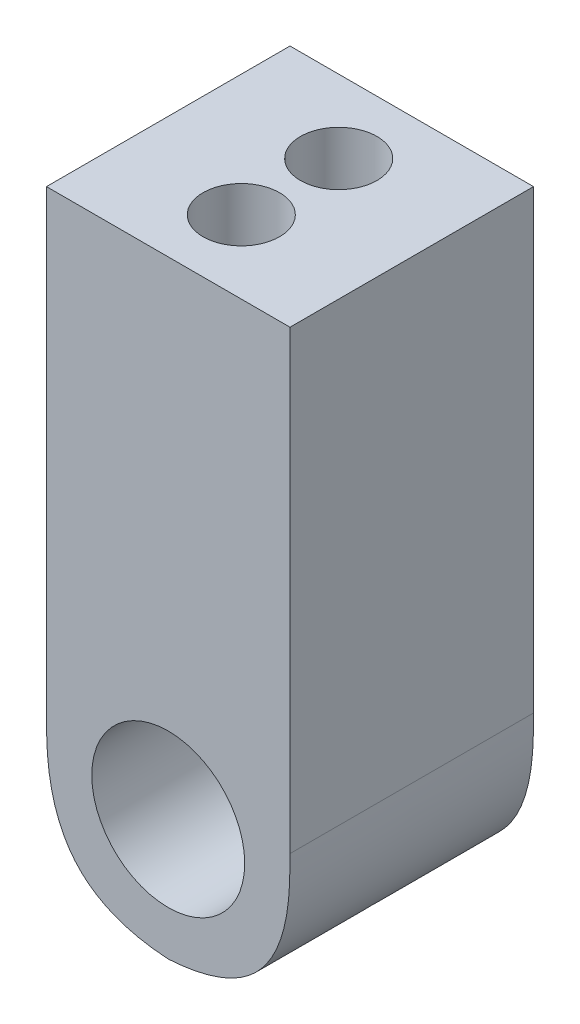
ISO-10303-21;
HEADER;
FILE_DESCRIPTION(('STEP AP214'),'2;1');
FILE_NAME('part.step','',(''),(''),'','','');
FILE_SCHEMA(('AUTOMOTIVE_DESIGN { 1 0 10303 214 1 1 1 1 }'));
ENDSEC;
DATA;
#1=APPLICATION_CONTEXT('core data for automotive mechanical design processes');
#2=APPLICATION_PROTOCOL_DEFINITION('international standard','automotive_design',2000,#1);
#3=PRODUCT_CONTEXT('',#1,'mechanical');
#4=PRODUCT('Part','Part','',(#3));
#5=PRODUCT_RELATED_PRODUCT_CATEGORY('part','',(#4));
#6=PRODUCT_DEFINITION_FORMATION('','',#4);
#7=PRODUCT_DEFINITION_CONTEXT('part definition',#1,'design');
#8=PRODUCT_DEFINITION('design','',#6,#7);
#9=PRODUCT_DEFINITION_SHAPE('','',#8);
#10=(LENGTH_UNIT() NAMED_UNIT(*) SI_UNIT(.MILLI.,.METRE.));
#11=(NAMED_UNIT(*) PLANE_ANGLE_UNIT() SI_UNIT($,.RADIAN.));
#12=(NAMED_UNIT(*) SI_UNIT($,.STERADIAN.) SOLID_ANGLE_UNIT());
#13=UNCERTAINTY_MEASURE_WITH_UNIT(LENGTH_MEASURE(1.E-05),#10,'distance_accuracy_value','');
#14=(GEOMETRIC_REPRESENTATION_CONTEXT(3) GLOBAL_UNCERTAINTY_ASSIGNED_CONTEXT((#13)) GLOBAL_UNIT_ASSIGNED_CONTEXT((#10,
#11,#12)) REPRESENTATION_CONTEXT('',''));
#15=CARTESIAN_POINT('',(0.,0.,0.));
#16=DIRECTION('',(0.,0.,1.));
#17=DIRECTION('',(1.,0.,0.));
#18=AXIS2_PLACEMENT_3D('',#15,#16,#17);
#19=CARTESIAN_POINT('',(-6.35,0.,-12.7));
#20=DIRECTION('',(1.,0.,0.));
#21=DIRECTION('',(0.,0.,-1.));
#22=AXIS2_PLACEMENT_3D('',#19,#20,#21);
#23=PLANE('',#22);
#24=DIRECTION('',(0.,1.,0.));
#25=VECTOR('',#24,1.);
#26=CARTESIAN_POINT('',(-6.35,0.,-12.7));
#27=LINE('',#26,#25);
#28=CARTESIAN_POINT('',(-6.35,1.6256,-12.7));
#29=VERTEX_POINT('',#28);
#30=CARTESIAN_POINT('',(-6.35,25.4,-12.7));
#31=VERTEX_POINT('',#30);
#32=EDGE_CURVE('E99',#29,#31,#27,.T.);
#33=ORIENTED_EDGE('',*,*,#32,.F.);
#34=CARTESIAN_POINT('',(-6.35,1.6256,0.635));
#35=CARTESIAN_POINT('',(-6.35,1.6256,-4.02166666666667));
#36=CARTESIAN_POINT('',(-6.35,1.6256,-8.67833333332475));
#37=CARTESIAN_POINT('',(-6.35,1.6256,-13.335));
#38=B_SPLINE_CURVE_WITH_KNOTS('',3,(#34,#35,#36,#37),.UNSPECIFIED.,.F.,.F.,(4,4),(-0.013335,
0.000635),.UNSPECIFIED.);
#39=CARTESIAN_POINT('',(-6.35,1.6256,0.));
#40=VERTEX_POINT('',#39);
#41=EDGE_CURVE('E113',#29,#40,#38,.F.);
#42=ORIENTED_EDGE('',*,*,#41,.T.);
#43=DIRECTION('',(0.,1.,0.));
#44=VECTOR('',#43,1.);
#45=CARTESIAN_POINT('',(-6.35,0.,0.));
#46=LINE('',#45,#44);
#47=CARTESIAN_POINT('',(-6.35,25.4,0.));
#48=VERTEX_POINT('',#47);
#49=EDGE_CURVE('E117',#40,#48,#46,.T.);
#50=ORIENTED_EDGE('',*,*,#49,.T.);
#51=DIRECTION('',(0.,0.,1.));
#52=VECTOR('',#51,1.);
#53=CARTESIAN_POINT('',(-6.35,25.4,-12.7));
#54=LINE('',#53,#52);
#55=EDGE_CURVE('E111',#31,#48,#54,.T.);
#56=ORIENTED_EDGE('',*,*,#55,.F.);
#57=EDGE_LOOP('',(#33,#42,#50,#56));
#58=FACE_BOUND('',#57,.T.);
#59=ADVANCED_FACE('F40',(#58),#23,.F.);
#60=CARTESIAN_POINT('',(0.,25.4,-12.7));
#61=DIRECTION('',(0.,-1.,0.));
#62=DIRECTION('',(0.,0.,-1.));
#63=AXIS2_PLACEMENT_3D('',#60,#61,#62);
#64=PLANE('',#63);
#65=CARTESIAN_POINT('',(0.,25.4,-8.89));
#66=DIRECTION('',(0.,1.,0.));
#67=DIRECTION('',(0.,0.,1.));
#68=AXIS2_PLACEMENT_3D('',#65,#66,#67);
#69=CIRCLE('',#68,1.9939);
#70=CARTESIAN_POINT('',(0.,25.4,-6.8961));
#71=VERTEX_POINT('',#70);
#72=EDGE_CURVE('E176',#71,#71,#69,.T.);
#73=ORIENTED_EDGE('',*,*,#72,.F.);
#74=EDGE_LOOP('',(#73));
#75=FACE_BOUND('',#74,.T.);
#76=CARTESIAN_POINT('',(0.,25.4,-3.81));
#77=DIRECTION('',(0.,1.,0.));
#78=DIRECTION('',(0.,0.,1.));
#79=AXIS2_PLACEMENT_3D('',#76,#77,#78);
#80=CIRCLE('',#79,1.9939);
#81=CARTESIAN_POINT('',(0.,25.4,-1.8161));
#82=VERTEX_POINT('',#81);
#83=EDGE_CURVE('E169',#82,#82,#80,.T.);
#84=ORIENTED_EDGE('',*,*,#83,.F.);
#85=EDGE_LOOP('',(#84));
#86=FACE_BOUND('',#85,.T.);
#87=DIRECTION('',(1.,0.,0.));
#88=VECTOR('',#87,1.);
#89=CARTESIAN_POINT('',(0.,25.4,0.));
#90=LINE('',#89,#88);
#91=CARTESIAN_POINT('',(6.35,25.4,0.));
#92=VERTEX_POINT('',#91);
#93=EDGE_CURVE('E110',#48,#92,#90,.T.);
#94=ORIENTED_EDGE('',*,*,#93,.T.);
#95=DIRECTION('',(0.,0.,1.));
#96=VECTOR('',#95,1.);
#97=CARTESIAN_POINT('',(6.35,25.4,-12.7));
#98=LINE('',#97,#96);
#99=CARTESIAN_POINT('',(6.35,25.4,-12.7));
#100=VERTEX_POINT('',#99);
#101=EDGE_CURVE('E96',#100,#92,#98,.T.);
#102=ORIENTED_EDGE('',*,*,#101,.F.);
#103=DIRECTION('',(1.,0.,0.));
#104=VECTOR('',#103,1.);
#105=CARTESIAN_POINT('',(0.,25.4,-12.7));
#106=LINE('',#105,#104);
#107=EDGE_CURVE('E98',#31,#100,#106,.T.);
#108=ORIENTED_EDGE('',*,*,#107,.F.);
#109=ORIENTED_EDGE('',*,*,#55,.T.);
#110=EDGE_LOOP('',(#94,#102,#108,#109));
#111=FACE_BOUND('',#110,.T.);
#112=ADVANCED_FACE('F108',(#75,#86,#111),#64,.F.);
#113=CARTESIAN_POINT('',(6.35,0.,-12.7));
#114=DIRECTION('',(1.,0.,0.));
#115=DIRECTION('',(0.,0.,-1.));
#116=AXIS2_PLACEMENT_3D('',#113,#114,#115);
#117=PLANE('',#116);
#118=DIRECTION('',(0.,1.,0.));
#119=VECTOR('',#118,1.);
#120=CARTESIAN_POINT('',(6.35,0.,0.));
#121=LINE('',#120,#119);
#122=CARTESIAN_POINT('',(6.35,1.6256,0.));
#123=VERTEX_POINT('',#122);
#124=EDGE_CURVE('E120',#123,#92,#121,.T.);
#125=ORIENTED_EDGE('',*,*,#124,.F.);
#126=CARTESIAN_POINT('',(6.35,1.6256,-13.335));
#127=CARTESIAN_POINT('',(6.35,1.6256,-8.67833333332475));
#128=CARTESIAN_POINT('',(6.35,1.6256,-4.02166666666667));
#129=CARTESIAN_POINT('',(6.35,1.6256,0.634999999999998));
#130=B_SPLINE_CURVE_WITH_KNOTS('',3,(#126,#127,#128,#129),.UNSPECIFIED.,.F.,.F.,(4,4),
(-0.000635,0.013335),.UNSPECIFIED.);
#131=CARTESIAN_POINT('',(6.35,1.6256,-12.7));
#132=VERTEX_POINT('',#131);
#133=EDGE_CURVE('E11',#123,#132,#130,.F.);
#134=ORIENTED_EDGE('',*,*,#133,.T.);
#135=DIRECTION('',(0.,1.,0.));
#136=VECTOR('',#135,1.);
#137=CARTESIAN_POINT('',(6.35,0.,-12.7));
#138=LINE('',#137,#136);
#139=EDGE_CURVE('E92',#132,#100,#138,.T.);
#140=ORIENTED_EDGE('',*,*,#139,.T.);
#141=ORIENTED_EDGE('',*,*,#101,.T.);
#142=EDGE_LOOP('',(#125,#134,#140,#141));
#143=FACE_BOUND('',#142,.T.);
#144=ADVANCED_FACE('F94',(#143),#117,.T.);
#145=CARTESIAN_POINT('',(0.,0.,-12.7));
#146=DIRECTION('',(0.,0.,1.));
#147=DIRECTION('',(1.,0.,0.));
#148=AXIS2_PLACEMENT_3D('',#145,#146,#147);
#149=PLANE('',#148);
#150=CARTESIAN_POINT('',(-1.6256,-6.35,-12.7));
#151=CARTESIAN_POINT('',(-0.284119620185859,-6.35,-12.7));
#152=CARTESIAN_POINT('',(1.05736075962828,-6.35,-12.7));
#153=CARTESIAN_POINT('',(4.01400084403143,-5.77821392415533,-12.7));
#154=CARTESIAN_POINT('',(5.77821392415533,-4.01400084403143,-12.7));
#155=CARTESIAN_POINT('',(6.35,-1.05736075962829,-12.7));
#156=CARTESIAN_POINT('',(6.35,0.284119620185857,-12.7));
#157=CARTESIAN_POINT('',(6.35,1.6256,-12.7));
#158=B_SPLINE_CURVE_WITH_KNOTS('',5,(#150,#151,#152,#153,#154,#155,#156,#157),.UNSPECIFIED.,.F.,
.F.,(6,2,6),(0.,0.5,1.),.UNSPECIFIED.);
#159=CARTESIAN_POINT('',(-7.25062341599403E-07,-6.3144499642676,-12.7));
#160=VERTEX_POINT('',#159);
#161=EDGE_CURVE('E61',#132,#160,#158,.F.);
#162=ORIENTED_EDGE('',*,*,#161,.T.);
#163=CARTESIAN_POINT('',(-6.35,1.6256,-12.7));
#164=CARTESIAN_POINT('',(-6.35,0.284119620185856,-12.7));
#165=CARTESIAN_POINT('',(-6.35,-1.05736075962829,-12.7));
#166=CARTESIAN_POINT('',(-5.77821392415534,-4.01400084403143,-12.7));
#167=CARTESIAN_POINT('',(-4.01400084403143,-5.77821392415533,-12.7));
#168=CARTESIAN_POINT('',(-1.05736075962829,-6.35,-12.7));
#169=CARTESIAN_POINT('',(0.284119620185855,-6.35,-12.7));
#170=CARTESIAN_POINT('',(1.6256,-6.35,-12.7));
#171=B_SPLINE_CURVE_WITH_KNOTS('',5,(#163,#164,#165,#166,#167,#168,#169,#170),.UNSPECIFIED.,.F.,
.F.,(6,2,6),(0.,0.5,1.),.UNSPECIFIED.);
#172=EDGE_CURVE('E54',#160,#29,#171,.F.);
#173=ORIENTED_EDGE('',*,*,#172,.T.);
#174=ORIENTED_EDGE('',*,*,#32,.T.);
#175=ORIENTED_EDGE('',*,*,#107,.T.);
#176=ORIENTED_EDGE('',*,*,#139,.F.);
#177=EDGE_LOOP('',(#162,#173,#174,#175,#176));
#178=FACE_BOUND('',#177,.T.);
#179=ADVANCED_FACE('F102',(#178),#149,.F.);
#180=CARTESIAN_POINT('',(0.,0.,0.));
#181=DIRECTION('',(0.,0.,1.));
#182=DIRECTION('',(1.,0.,0.));
#183=AXIS2_PLACEMENT_3D('',#180,#181,#182);
#184=PLANE('',#183);
#185=CARTESIAN_POINT('',(0.,0.,0.));
#186=DIRECTION('',(0.,0.,1.));
#187=DIRECTION('',(1.,0.,0.));
#188=AXIS2_PLACEMENT_3D('',#185,#186,#187);
#189=CIRCLE('',#188,3.9878);
#190=CARTESIAN_POINT('',(3.9878,0.,0.));
#191=VERTEX_POINT('',#190);
#192=EDGE_CURVE('E182',#191,#191,#189,.T.);
#193=ORIENTED_EDGE('',*,*,#192,.F.);
#194=EDGE_LOOP('',(#193));
#195=FACE_BOUND('',#194,.T.);
#196=ORIENTED_EDGE('',*,*,#49,.F.);
#197=CARTESIAN_POINT('',(1.6256,-6.35,0.));
#198=CARTESIAN_POINT('',(0.284119620185855,-6.35,0.));
#199=CARTESIAN_POINT('',(-1.05736075962829,-6.35,0.));
#200=CARTESIAN_POINT('',(-4.01400084403143,-5.77821392415533,0.));
#201=CARTESIAN_POINT('',(-5.77821392415534,-4.01400084403143,0.));
#202=CARTESIAN_POINT('',(-6.35,-1.05736075962829,0.));
#203=CARTESIAN_POINT('',(-6.35,0.284119620185856,0.));
#204=CARTESIAN_POINT('',(-6.35,1.6256,0.));
#205=B_SPLINE_CURVE_WITH_KNOTS('',5,(#197,#198,#199,#200,#201,#202,#203,#204),.UNSPECIFIED.,.F.,
.F.,(6,2,6),(0.,0.5,1.),.UNSPECIFIED.);
#206=CARTESIAN_POINT('',(-4.50984004952076E-07,-6.31445417406303,0.));
#207=VERTEX_POINT('',#206);
#208=EDGE_CURVE('E197',#40,#207,#205,.F.);
#209=ORIENTED_EDGE('',*,*,#208,.T.);
#210=CARTESIAN_POINT('',(6.35,1.6256,0.));
#211=CARTESIAN_POINT('',(6.35,0.284119620185857,0.));
#212=CARTESIAN_POINT('',(6.35,-1.05736075962829,0.));
#213=CARTESIAN_POINT('',(5.77821392415533,-4.01400084403143,0.));
#214=CARTESIAN_POINT('',(4.01400084403143,-5.77821392415533,0.));
#215=CARTESIAN_POINT('',(1.05736075962828,-6.35,0.));
#216=CARTESIAN_POINT('',(-0.284119620185859,-6.35,0.));
#217=CARTESIAN_POINT('',(-1.6256,-6.35,0.));
#218=B_SPLINE_CURVE_WITH_KNOTS('',5,(#210,#211,#212,#213,#214,#215,#216,#217),.UNSPECIFIED.,.F.,
.F.,(6,2,6),(0.,0.5,1.),.UNSPECIFIED.);
#219=EDGE_CURVE('E137',#207,#123,#218,.F.);
#220=ORIENTED_EDGE('',*,*,#219,.T.);
#221=ORIENTED_EDGE('',*,*,#124,.T.);
#222=ORIENTED_EDGE('',*,*,#93,.F.);
#223=EDGE_LOOP('',(#196,#209,#220,#221,#222));
#224=FACE_BOUND('',#223,.T.);
#225=ADVANCED_FACE('F143',(#195,#224),#184,.T.);
#226=CARTESIAN_POINT('',(-1.6256,-6.35,-13.335));
#227=CARTESIAN_POINT('',(-1.6256,-6.35,-8.67833333332475));
#228=CARTESIAN_POINT('',(-1.6256,-6.35,-4.02166666666667));
#229=CARTESIAN_POINT('',(-1.6256,-6.35,0.634999999999998));
#230=CARTESIAN_POINT('',(-0.284119620185859,-6.35,-13.335));
#231=CARTESIAN_POINT('',(-0.284119620185859,-6.35,-8.67833333332475));
#232=CARTESIAN_POINT('',(-0.284119620185859,-6.35,-4.02166666666667));
#233=CARTESIAN_POINT('',(-0.284119620185859,-6.35,0.634999999999998));
#234=CARTESIAN_POINT('',(1.05736075962828,-6.35,-13.335));
#235=CARTESIAN_POINT('',(1.05736075962828,-6.35,-8.67833333332475));
#236=CARTESIAN_POINT('',(1.05736075962828,-6.35,-4.02166666666667));
#237=CARTESIAN_POINT('',(1.05736075962828,-6.35,0.634999999999998));
#238=CARTESIAN_POINT('',(4.01400084403143,-5.77821392415533,-13.335));
#239=CARTESIAN_POINT('',(4.01400084403143,-5.77821392415533,-8.67833333332475));
#240=CARTESIAN_POINT('',(4.01400084403143,-5.77821392415533,-4.02166666666667));
#241=CARTESIAN_POINT('',(4.01400084403143,-5.77821392415533,0.634999999999998));
#242=CARTESIAN_POINT('',(5.77821392415533,-4.01400084403143,-13.335));
#243=CARTESIAN_POINT('',(5.77821392415533,-4.01400084403143,-8.67833333332475));
#244=CARTESIAN_POINT('',(5.77821392415533,-4.01400084403143,-4.02166666666667));
#245=CARTESIAN_POINT('',(5.77821392415533,-4.01400084403143,0.634999999999998));
#246=CARTESIAN_POINT('',(6.35,-1.05736075962829,-13.335));
#247=CARTESIAN_POINT('',(6.35,-1.05736075962829,-8.67833333332475));
#248=CARTESIAN_POINT('',(6.35,-1.05736075962829,-4.02166666666667));
#249=CARTESIAN_POINT('',(6.35,-1.05736075962829,0.634999999999998));
#250=CARTESIAN_POINT('',(6.35,0.284119620185857,-13.335));
#251=CARTESIAN_POINT('',(6.35,0.284119620185857,-8.67833333332475));
#252=CARTESIAN_POINT('',(6.35,0.284119620185857,-4.02166666666667));
#253=CARTESIAN_POINT('',(6.35,0.284119620185857,0.634999999999998));
#254=CARTESIAN_POINT('',(6.35,1.6256,-13.335));
#255=CARTESIAN_POINT('',(6.35,1.6256,-8.67833333332475));
#256=CARTESIAN_POINT('',(6.35,1.6256,-4.02166666666667));
#257=CARTESIAN_POINT('',(6.35,1.6256,0.634999999999998));
#258=B_SPLINE_SURFACE_WITH_KNOTS('',5,3,((#226,#227,#228,#229),(#230,#231,#232,#233),(#234,#235,
#236,#237),(#238,#239,#240,#241),(#242,#243,#244,#245),(#246,#247,#248,#249),(#250,#251,#252,
#253),(#254,#255,#256,#257)),.UNSPECIFIED.,.F.,.F.,.F.,(6,2,6),(4,4),(0.,0.5,1.),(-0.000635,
0.013335),.UNSPECIFIED.);
#259=CARTESIAN_POINT('',(0.,-6.31446149156776,-13.335));
#260=CARTESIAN_POINT('',(0.,-6.31446149156776,-8.67833333332475));
#261=CARTESIAN_POINT('',(0.,-6.31446149156776,-4.02166666666667));
#262=CARTESIAN_POINT('',(0.,-6.31446149156776,0.635));
#263=B_SPLINE_CURVE_WITH_KNOTS('',3,(#259,#260,#261,#262),.UNSPECIFIED.,.F.,.F.,(4,4),
(-0.013335,0.000635),.UNSPECIFIED.);
#264=EDGE_CURVE('E121',#160,#207,#263,.T.);
#265=ORIENTED_EDGE('',*,*,#264,.F.);
#266=ORIENTED_EDGE('',*,*,#161,.F.);
#267=ORIENTED_EDGE('',*,*,#133,.F.);
#268=ORIENTED_EDGE('',*,*,#219,.F.);
#269=EDGE_LOOP('',(#265,#266,#267,#268));
#270=FACE_BOUND('',#269,.T.);
#271=ADVANCED_FACE('F43',(#270),#258,.T.);
#272=CARTESIAN_POINT('',(1.6256,-6.35,0.635));
#273=CARTESIAN_POINT('',(1.6256,-6.35,-4.02166666666667));
#274=CARTESIAN_POINT('',(1.6256,-6.35,-8.67833333332475));
#275=CARTESIAN_POINT('',(1.6256,-6.35,-13.335));
#276=CARTESIAN_POINT('',(0.284119620185855,-6.35,0.635));
#277=CARTESIAN_POINT('',(0.284119620185855,-6.35,-4.02166666666667));
#278=CARTESIAN_POINT('',(0.284119620185855,-6.35,-8.67833333332475));
#279=CARTESIAN_POINT('',(0.284119620185855,-6.35,-13.335));
#280=CARTESIAN_POINT('',(-1.05736075962829,-6.35,0.635));
#281=CARTESIAN_POINT('',(-1.05736075962829,-6.35,-4.02166666666667));
#282=CARTESIAN_POINT('',(-1.05736075962829,-6.35,-8.67833333332475));
#283=CARTESIAN_POINT('',(-1.05736075962829,-6.35,-13.335));
#284=CARTESIAN_POINT('',(-4.01400084403143,-5.77821392415533,0.635));
#285=CARTESIAN_POINT('',(-4.01400084403143,-5.77821392415533,-4.02166666666667));
#286=CARTESIAN_POINT('',(-4.01400084403143,-5.77821392415533,-8.67833333332475));
#287=CARTESIAN_POINT('',(-4.01400084403143,-5.77821392415533,-13.335));
#288=CARTESIAN_POINT('',(-5.77821392415534,-4.01400084403143,0.635));
#289=CARTESIAN_POINT('',(-5.77821392415534,-4.01400084403143,-4.02166666666667));
#290=CARTESIAN_POINT('',(-5.77821392415534,-4.01400084403143,-8.67833333332475));
#291=CARTESIAN_POINT('',(-5.77821392415534,-4.01400084403143,-13.335));
#292=CARTESIAN_POINT('',(-6.35,-1.05736075962829,0.635));
#293=CARTESIAN_POINT('',(-6.35,-1.05736075962829,-4.02166666666667));
#294=CARTESIAN_POINT('',(-6.35,-1.05736075962829,-8.67833333332475));
#295=CARTESIAN_POINT('',(-6.35,-1.05736075962829,-13.335));
#296=CARTESIAN_POINT('',(-6.35,0.284119620185856,0.635));
#297=CARTESIAN_POINT('',(-6.35,0.284119620185856,-4.02166666666667));
#298=CARTESIAN_POINT('',(-6.35,0.284119620185856,-8.67833333332475));
#299=CARTESIAN_POINT('',(-6.35,0.284119620185856,-13.335));
#300=CARTESIAN_POINT('',(-6.35,1.6256,0.635));
#301=CARTESIAN_POINT('',(-6.35,1.6256,-4.02166666666667));
#302=CARTESIAN_POINT('',(-6.35,1.6256,-8.67833333332475));
#303=CARTESIAN_POINT('',(-6.35,1.6256,-13.335));
#304=B_SPLINE_SURFACE_WITH_KNOTS('',5,3,((#272,#273,#274,#275),(#276,#277,#278,#279),(#280,#281,
#282,#283),(#284,#285,#286,#287),(#288,#289,#290,#291),(#292,#293,#294,#295),(#296,#297,#298,
#299),(#300,#301,#302,#303)),.UNSPECIFIED.,.F.,.F.,.F.,(6,2,6),(4,4),(0.,0.5,1.),(-0.013335,
0.000635),.UNSPECIFIED.);
#305=ORIENTED_EDGE('',*,*,#172,.F.);
#306=ORIENTED_EDGE('',*,*,#264,.T.);
#307=ORIENTED_EDGE('',*,*,#208,.F.);
#308=ORIENTED_EDGE('',*,*,#41,.F.);
#309=EDGE_LOOP('',(#305,#306,#307,#308));
#310=FACE_BOUND('',#309,.T.);
#311=ADVANCED_FACE('F232',(#310),#304,.T.);
#312=CARTESIAN_POINT('',(0.,19.05,-3.81));
#313=DIRECTION('',(0.,1.,0.));
#314=DIRECTION('',(0.,0.,1.));
#315=AXIS2_PLACEMENT_3D('',#312,#313,#314);
#316=CYLINDRICAL_SURFACE('',#315,1.9939);
#317=CARTESIAN_POINT('',(0.,19.05,-3.81));
#318=DIRECTION('',(0.,1.,0.));
#319=DIRECTION('',(0.,0.,1.));
#320=AXIS2_PLACEMENT_3D('',#317,#318,#319);
#321=CIRCLE('',#320,1.9939);
#322=CARTESIAN_POINT('',(0.,19.05,-1.8161));
#323=VERTEX_POINT('',#322);
#324=EDGE_CURVE('E172',#323,#323,#321,.T.);
#325=ORIENTED_EDGE('',*,*,#324,.F.);
#326=EDGE_LOOP('',(#325));
#327=FACE_BOUND('',#326,.T.);
#328=ORIENTED_EDGE('',*,*,#83,.T.);
#329=EDGE_LOOP('',(#328));
#330=FACE_BOUND('',#329,.T.);
#331=ADVANCED_FACE('F239',(#327,#330),#316,.F.);
#332=CARTESIAN_POINT('',(0.,19.05,0.));
#333=DIRECTION('',(0.,1.,0.));
#334=DIRECTION('',(0.,0.,1.));
#335=AXIS2_PLACEMENT_3D('',#332,#333,#334);
#336=PLANE('',#335);
#337=ORIENTED_EDGE('',*,*,#324,.T.);
#338=EDGE_LOOP('',(#337));
#339=FACE_BOUND('',#338,.T.);
#340=ADVANCED_FACE('F316',(#339),#336,.T.);
#341=CARTESIAN_POINT('',(0.,19.05,-8.89));
#342=DIRECTION('',(0.,1.,0.));
#343=DIRECTION('',(0.,0.,1.));
#344=AXIS2_PLACEMENT_3D('',#341,#342,#343);
#345=CYLINDRICAL_SURFACE('',#344,1.9939);
#346=CARTESIAN_POINT('',(0.,19.05,-8.89));
#347=DIRECTION('',(0.,1.,0.));
#348=DIRECTION('',(0.,0.,1.));
#349=AXIS2_PLACEMENT_3D('',#346,#347,#348);
#350=CIRCLE('',#349,1.9939);
#351=CARTESIAN_POINT('',(0.,19.05,-6.8961));
#352=VERTEX_POINT('',#351);
#353=EDGE_CURVE('E179',#352,#352,#350,.T.);
#354=ORIENTED_EDGE('',*,*,#353,.F.);
#355=EDGE_LOOP('',(#354));
#356=FACE_BOUND('',#355,.T.);
#357=ORIENTED_EDGE('',*,*,#72,.T.);
#358=EDGE_LOOP('',(#357));
#359=FACE_BOUND('',#358,.T.);
#360=ADVANCED_FACE('F323',(#356,#359),#345,.F.);
#361=CARTESIAN_POINT('',(0.,19.05,0.));
#362=DIRECTION('',(0.,1.,0.));
#363=DIRECTION('',(0.,0.,1.));
#364=AXIS2_PLACEMENT_3D('',#361,#362,#363);
#365=PLANE('',#364);
#366=ORIENTED_EDGE('',*,*,#353,.T.);
#367=EDGE_LOOP('',(#366));
#368=FACE_BOUND('',#367,.T.);
#369=ADVANCED_FACE('F193',(#368),#365,.T.);
#370=CARTESIAN_POINT('',(0.,0.,-6.35));
#371=DIRECTION('',(0.,0.,1.));
#372=DIRECTION('',(1.,0.,0.));
#373=AXIS2_PLACEMENT_3D('',#370,#371,#372);
#374=CYLINDRICAL_SURFACE('',#373,3.9878);
#375=CARTESIAN_POINT('',(0.,0.,-6.35));
#376=DIRECTION('',(0.,0.,1.));
#377=DIRECTION('',(1.,0.,0.));
#378=AXIS2_PLACEMENT_3D('',#375,#376,#377);
#379=CIRCLE('',#378,3.9878);
#380=CARTESIAN_POINT('',(3.9878,0.,-6.35));
#381=VERTEX_POINT('',#380);
#382=EDGE_CURVE('E173',#381,#381,#379,.T.);
#383=ORIENTED_EDGE('',*,*,#382,.F.);
#384=EDGE_LOOP('',(#383));
#385=FACE_BOUND('',#384,.T.);
#386=ORIENTED_EDGE('',*,*,#192,.T.);
#387=EDGE_LOOP('',(#386));
#388=FACE_BOUND('',#387,.T.);
#389=ADVANCED_FACE('F190',(#385,#388),#374,.F.);
#390=CARTESIAN_POINT('',(0.,0.,-6.35));
#391=DIRECTION('',(0.,0.,1.));
#392=DIRECTION('',(1.,0.,0.));
#393=AXIS2_PLACEMENT_3D('',#390,#391,#392);
#394=PLANE('',#393);
#395=ORIENTED_EDGE('',*,*,#382,.T.);
#396=EDGE_LOOP('',(#395));
#397=FACE_BOUND('',#396,.T.);
#398=ADVANCED_FACE('F188',(#397),#394,.T.);
#399=CLOSED_SHELL('',(#59,#112,#144,#179,#225,#271,#311,#331,#340,#360,#369,#389,#398));
#400=MANIFOLD_SOLID_BREP('B2',#399);
#401=ADVANCED_BREP_SHAPE_REPRESENTATION('',(#18,#400),#14);
#402=SHAPE_DEFINITION_REPRESENTATION(#9,#401);
ENDSEC;
END-ISO-10303-21;
